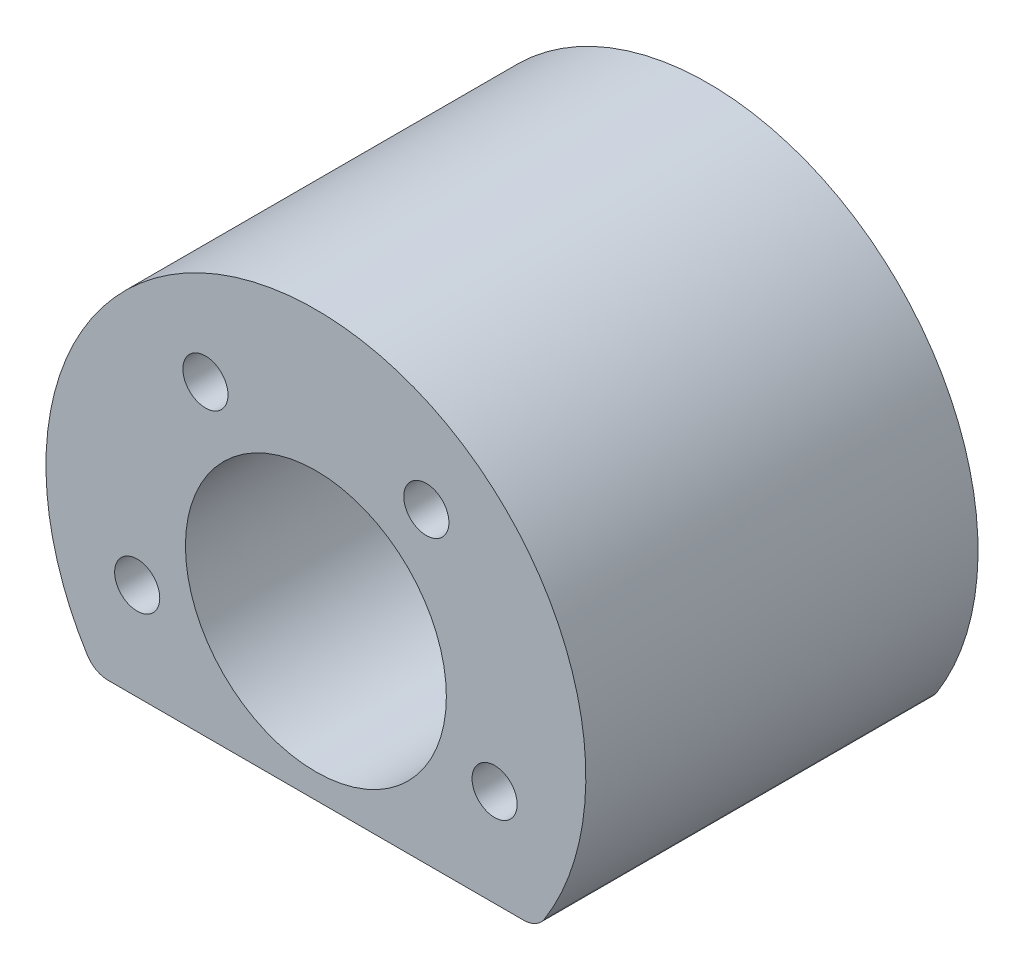
ISO-10303-21;
HEADER;
FILE_DESCRIPTION(('STEP AP214'),'2;1');
FILE_NAME('part.step','',(''),(''),'','','');
FILE_SCHEMA(('AUTOMOTIVE_DESIGN { 1 0 10303 214 1 1 1 1 }'));
ENDSEC;
DATA;
#1=APPLICATION_CONTEXT('core data for automotive mechanical design processes');
#2=APPLICATION_PROTOCOL_DEFINITION('international standard','automotive_design',2000,#1);
#3=PRODUCT_CONTEXT('',#1,'mechanical');
#4=PRODUCT('Part','Part','',(#3));
#5=PRODUCT_RELATED_PRODUCT_CATEGORY('part','',(#4));
#6=PRODUCT_DEFINITION_FORMATION('','',#4);
#7=PRODUCT_DEFINITION_CONTEXT('part definition',#1,'design');
#8=PRODUCT_DEFINITION('design','',#6,#7);
#9=PRODUCT_DEFINITION_SHAPE('','',#8);
#10=(LENGTH_UNIT() NAMED_UNIT(*) SI_UNIT(.MILLI.,.METRE.));
#11=(NAMED_UNIT(*) PLANE_ANGLE_UNIT() SI_UNIT($,.RADIAN.));
#12=(NAMED_UNIT(*) SI_UNIT($,.STERADIAN.) SOLID_ANGLE_UNIT());
#13=UNCERTAINTY_MEASURE_WITH_UNIT(LENGTH_MEASURE(1.E-05),#10,'distance_accuracy_value','');
#14=(GEOMETRIC_REPRESENTATION_CONTEXT(3) GLOBAL_UNCERTAINTY_ASSIGNED_CONTEXT((#13)) GLOBAL_UNIT_ASSIGNED_CONTEXT((#10,
#11,#12)) REPRESENTATION_CONTEXT('',''));
#15=CARTESIAN_POINT('',(0.,0.,0.));
#16=DIRECTION('',(0.,0.,1.));
#17=DIRECTION('',(1.,0.,0.));
#18=AXIS2_PLACEMENT_3D('',#15,#16,#17);
#19=CARTESIAN_POINT('',(0.,-18.9,44.8));
#20=DIRECTION('',(0.,1.,0.));
#21=DIRECTION('',(0.,0.,1.));
#22=AXIS2_PLACEMENT_3D('',#19,#20,#21);
#23=PLANE('',#22);
#24=DIRECTION('',(1.,0.,0.));
#25=VECTOR('',#24,1.);
#26=CARTESIAN_POINT('',(0.,-18.9,44.8));
#27=LINE('',#26,#25);
#28=CARTESIAN_POINT('',(-25.3219272568262,-18.9,44.8));
#29=VERTEX_POINT('',#28);
#30=CARTESIAN_POINT('',(25.3219272568262,-18.9,44.8));
#31=VERTEX_POINT('',#30);
#32=EDGE_CURVE('E95',#29,#31,#27,.T.);
#33=ORIENTED_EDGE('',*,*,#32,.F.);
#34=DIRECTION('',(0.,0.,-1.));
#35=VECTOR('',#34,1.);
#36=CARTESIAN_POINT('',(-25.3219272568262,-18.9,44.8));
#37=LINE('',#36,#35);
#38=CARTESIAN_POINT('',(-25.3219272568262,-18.9,-3.));
#39=VERTEX_POINT('',#38);
#40=EDGE_CURVE('E83',#29,#39,#37,.T.);
#41=ORIENTED_EDGE('',*,*,#40,.T.);
#42=DIRECTION('',(1.,0.,0.));
#43=VECTOR('',#42,1.);
#44=CARTESIAN_POINT('',(0.,-18.9,-3.));
#45=LINE('',#44,#43);
#46=CARTESIAN_POINT('',(25.3219272568262,-18.9,-3.));
#47=VERTEX_POINT('',#46);
#48=EDGE_CURVE('E93',#39,#47,#45,.T.);
#49=ORIENTED_EDGE('',*,*,#48,.T.);
#50=DIRECTION('',(0.,0.,-1.));
#51=VECTOR('',#50,1.);
#52=CARTESIAN_POINT('',(25.3219272568262,-18.9,44.8));
#53=LINE('',#52,#51);
#54=EDGE_CURVE('E96',#47,#31,#53,.F.);
#55=ORIENTED_EDGE('',*,*,#54,.T.);
#56=EDGE_LOOP('',(#33,#41,#49,#55));
#57=FACE_BOUND('',#56,.T.);
#58=ADVANCED_FACE('F37',(#57),#23,.F.);
#59=CARTESIAN_POINT('',(0.,0.,44.8));
#60=DIRECTION('',(0.,0.,-1.));
#61=DIRECTION('',(-1.,0.,0.));
#62=AXIS2_PLACEMENT_3D('',#59,#60,#61);
#63=CYLINDRICAL_SURFACE('',#62,15.9);
#64=CARTESIAN_POINT('',(0.,0.,44.8));
#65=DIRECTION('',(0.,0.,1.));
#66=DIRECTION('',(1.,0.,0.));
#67=AXIS2_PLACEMENT_3D('',#64,#65,#66);
#68=CIRCLE('',#67,15.9);
#69=CARTESIAN_POINT('',(15.9,0.,44.8));
#70=VERTEX_POINT('',#69);
#71=EDGE_CURVE('E112',#70,#70,#68,.T.);
#72=ORIENTED_EDGE('',*,*,#71,.T.);
#73=EDGE_LOOP('',(#72));
#74=FACE_BOUND('',#73,.T.);
#75=CARTESIAN_POINT('',(0.,0.,0.));
#76=DIRECTION('',(0.,0.,1.));
#77=DIRECTION('',(1.,0.,0.));
#78=AXIS2_PLACEMENT_3D('',#75,#76,#77);
#79=CIRCLE('',#78,15.9);
#80=CARTESIAN_POINT('',(15.9,0.,0.));
#81=VERTEX_POINT('',#80);
#82=EDGE_CURVE('E102',#81,#81,#79,.T.);
#83=ORIENTED_EDGE('',*,*,#82,.F.);
#84=EDGE_LOOP('',(#83));
#85=FACE_BOUND('',#84,.T.);
#86=ADVANCED_FACE('F191',(#74,#85),#63,.F.);
#87=CARTESIAN_POINT('',(0.,0.,44.8));
#88=DIRECTION('',(0.,0.,-1.));
#89=DIRECTION('',(-1.,0.,0.));
#90=AXIS2_PLACEMENT_3D('',#87,#88,#89);
#91=CYLINDRICAL_SURFACE('',#90,32.9);
#92=CARTESIAN_POINT('',(0.,0.,-3.));
#93=DIRECTION('',(0.,0.,1.));
#94=DIRECTION('',(1.,0.,0.));
#95=AXIS2_PLACEMENT_3D('',#92,#93,#94);
#96=CIRCLE('',#95,32.9);
#97=CARTESIAN_POINT('',(27.8625888545011,-17.4953177257525,-3.));
#98=VERTEX_POINT('',#97);
#99=CARTESIAN_POINT('',(-27.8625888545011,-17.4953177257525,-3.));
#100=VERTEX_POINT('',#99);
#101=EDGE_CURVE('E99',#98,#100,#96,.T.);
#102=ORIENTED_EDGE('',*,*,#101,.T.);
#103=DIRECTION('',(0.,0.,-1.));
#104=VECTOR('',#103,1.);
#105=CARTESIAN_POINT('',(-27.8625888545011,-17.4953177257525,44.8));
#106=LINE('',#105,#104);
#107=CARTESIAN_POINT('',(-27.8625888545011,-17.4953177257525,44.8));
#108=VERTEX_POINT('',#107);
#109=EDGE_CURVE('E54',#100,#108,#106,.F.);
#110=ORIENTED_EDGE('',*,*,#109,.T.);
#111=CARTESIAN_POINT('',(0.,0.,44.8));
#112=DIRECTION('',(0.,0.,1.));
#113=DIRECTION('',(1.,0.,0.));
#114=AXIS2_PLACEMENT_3D('',#111,#112,#113);
#115=CIRCLE('',#114,32.9);
#116=CARTESIAN_POINT('',(27.8625888545011,-17.4953177257525,44.8));
#117=VERTEX_POINT('',#116);
#118=EDGE_CURVE('E116',#117,#108,#115,.T.);
#119=ORIENTED_EDGE('',*,*,#118,.F.);
#120=DIRECTION('',(0.,0.,-1.));
#121=VECTOR('',#120,1.);
#122=CARTESIAN_POINT('',(27.8625888545011,-17.4953177257525,44.8));
#123=LINE('',#122,#121);
#124=EDGE_CURVE('E87',#117,#98,#123,.T.);
#125=ORIENTED_EDGE('',*,*,#124,.T.);
#126=EDGE_LOOP('',(#102,#110,#119,#125));
#127=FACE_BOUND('',#126,.T.);
#128=ADVANCED_FACE('F174',(#127),#91,.T.);
#129=CARTESIAN_POINT('',(0.,0.,44.8));
#130=DIRECTION('',(0.,0.,1.));
#131=DIRECTION('',(1.,0.,0.));
#132=AXIS2_PLACEMENT_3D('',#129,#130,#131);
#133=PLANE('',#132);
#134=CARTESIAN_POINT('',(-13.4602822774975,18.5264891711864,44.8));
#135=DIRECTION('',(0.,0.,1.));
#136=DIRECTION('',(1.,0.,0.));
#137=AXIS2_PLACEMENT_3D('',#134,#135,#136);
#138=CIRCLE('',#137,2.74999999999999);
#139=CARTESIAN_POINT('',(-10.7102822774975,18.5264891711864,44.8));
#140=VERTEX_POINT('',#139);
#141=EDGE_CURVE('E129',#140,#140,#138,.T.);
#142=ORIENTED_EDGE('',*,*,#141,.F.);
#143=EDGE_LOOP('',(#142));
#144=FACE_BOUND('',#143,.T.);
#145=CARTESIAN_POINT('',(-21.779194223159,-7.07648917118623,44.8));
#146=DIRECTION('',(0.,0.,1.));
#147=DIRECTION('',(1.,0.,0.));
#148=AXIS2_PLACEMENT_3D('',#145,#146,#147);
#149=CIRCLE('',#148,2.74999999999999);
#150=CARTESIAN_POINT('',(-19.029194223159,-7.07648917118623,44.8));
#151=VERTEX_POINT('',#150);
#152=EDGE_CURVE('E160',#151,#151,#149,.T.);
#153=ORIENTED_EDGE('',*,*,#152,.F.);
#154=EDGE_LOOP('',(#153));
#155=FACE_BOUND('',#154,.T.);
#156=CARTESIAN_POINT('',(21.779194223159,-7.07648917118623,44.8));
#157=DIRECTION('',(0.,0.,1.));
#158=DIRECTION('',(1.,0.,0.));
#159=AXIS2_PLACEMENT_3D('',#156,#157,#158);
#160=CIRCLE('',#159,2.74999999999999);
#161=CARTESIAN_POINT('',(24.529194223159,-7.07648917118623,44.8));
#162=VERTEX_POINT('',#161);
#163=EDGE_CURVE('E163',#162,#162,#160,.T.);
#164=ORIENTED_EDGE('',*,*,#163,.F.);
#165=EDGE_LOOP('',(#164));
#166=FACE_BOUND('',#165,.T.);
#167=CARTESIAN_POINT('',(13.4602822774975,18.5264891711864,44.8));
#168=DIRECTION('',(0.,0.,1.));
#169=DIRECTION('',(1.,0.,0.));
#170=AXIS2_PLACEMENT_3D('',#167,#168,#169);
#171=CIRCLE('',#170,2.74999999999999);
#172=CARTESIAN_POINT('',(16.2102822774975,18.5264891711864,44.8));
#173=VERTEX_POINT('',#172);
#174=EDGE_CURVE('E111',#173,#173,#171,.T.);
#175=ORIENTED_EDGE('',*,*,#174,.F.);
#176=EDGE_LOOP('',(#175));
#177=FACE_BOUND('',#176,.T.);
#178=ORIENTED_EDGE('',*,*,#71,.F.);
#179=EDGE_LOOP('',(#178));
#180=FACE_BOUND('',#179,.T.);
#181=ORIENTED_EDGE('',*,*,#118,.T.);
#182=CARTESIAN_POINT('',(-25.3219272568262,-15.9,44.8));
#183=DIRECTION('',(0.,0.,1.));
#184=DIRECTION('',(1.,0.,0.));
#185=AXIS2_PLACEMENT_3D('',#182,#183,#184);
#186=CIRCLE('',#185,3.);
#187=EDGE_CURVE('E11',#108,#29,#186,.T.);
#188=ORIENTED_EDGE('',*,*,#187,.T.);
#189=ORIENTED_EDGE('',*,*,#32,.T.);
#190=CARTESIAN_POINT('',(25.3219272568262,-15.9,44.8));
#191=DIRECTION('',(0.,0.,1.));
#192=DIRECTION('',(1.,0.,0.));
#193=AXIS2_PLACEMENT_3D('',#190,#191,#192);
#194=CIRCLE('',#193,3.);
#195=EDGE_CURVE('E46',#31,#117,#194,.T.);
#196=ORIENTED_EDGE('',*,*,#195,.T.);
#197=EDGE_LOOP('',(#181,#188,#189,#196));
#198=FACE_BOUND('',#197,.T.);
#199=ADVANCED_FACE('F170',(#144,#155,#166,#177,#180,#198),#133,.T.);
#200=CARTESIAN_POINT('',(0.,0.,0.));
#201=DIRECTION('',(0.,0.,1.));
#202=DIRECTION('',(1.,0.,0.));
#203=AXIS2_PLACEMENT_3D('',#200,#201,#202);
#204=PLANE('',#203);
#205=CARTESIAN_POINT('',(0.,0.,0.));
#206=DIRECTION('',(0.,0.,1.));
#207=DIRECTION('',(1.,0.,0.));
#208=AXIS2_PLACEMENT_3D('',#205,#206,#207);
#209=CIRCLE('',#208,11.);
#210=CARTESIAN_POINT('',(11.,0.,0.));
#211=VERTEX_POINT('',#210);
#212=EDGE_CURVE('E105',#211,#211,#209,.T.);
#213=ORIENTED_EDGE('',*,*,#212,.F.);
#214=EDGE_LOOP('',(#213));
#215=FACE_BOUND('',#214,.T.);
#216=ORIENTED_EDGE('',*,*,#82,.T.);
#217=EDGE_LOOP('',(#216));
#218=FACE_BOUND('',#217,.T.);
#219=ADVANCED_FACE('F173',(#215,#218),#204,.T.);
#220=CARTESIAN_POINT('',(0.,0.,-3.));
#221=DIRECTION('',(0.,0.,1.));
#222=DIRECTION('',(1.,0.,0.));
#223=AXIS2_PLACEMENT_3D('',#220,#221,#222);
#224=CYLINDRICAL_SURFACE('',#223,11.);
#225=CARTESIAN_POINT('',(0.,0.,-3.));
#226=DIRECTION('',(0.,0.,1.));
#227=DIRECTION('',(1.,0.,0.));
#228=AXIS2_PLACEMENT_3D('',#225,#226,#227);
#229=CIRCLE('',#228,11.);
#230=CARTESIAN_POINT('',(11.,0.,-3.));
#231=VERTEX_POINT('',#230);
#232=EDGE_CURVE('E100',#231,#231,#229,.T.);
#233=ORIENTED_EDGE('',*,*,#232,.F.);
#234=EDGE_LOOP('',(#233));
#235=FACE_BOUND('',#234,.T.);
#236=ORIENTED_EDGE('',*,*,#212,.T.);
#237=EDGE_LOOP('',(#236));
#238=FACE_BOUND('',#237,.T.);
#239=ADVANCED_FACE('F201',(#235,#238),#224,.F.);
#240=CARTESIAN_POINT('',(0.,0.,-3.));
#241=DIRECTION('',(0.,0.,1.));
#242=DIRECTION('',(1.,0.,0.));
#243=AXIS2_PLACEMENT_3D('',#240,#241,#242);
#244=PLANE('',#243);
#245=CARTESIAN_POINT('',(13.4602822774975,18.5264891711864,-3.));
#246=DIRECTION('',(0.,0.,-1.));
#247=DIRECTION('',(-1.,0.,0.));
#248=AXIS2_PLACEMENT_3D('',#245,#246,#247);
#249=CIRCLE('',#248,3.2);
#250=CARTESIAN_POINT('',(10.2602822774975,18.5264891711864,-3.));
#251=VERTEX_POINT('',#250);
#252=EDGE_CURVE('E257',#251,#251,#249,.T.);
#253=ORIENTED_EDGE('',*,*,#252,.F.);
#254=EDGE_LOOP('',(#253));
#255=FACE_BOUND('',#254,.T.);
#256=CARTESIAN_POINT('',(21.779194223159,-7.07648917118623,-3.));
#257=DIRECTION('',(0.,0.,-1.));
#258=DIRECTION('',(-1.,0.,0.));
#259=AXIS2_PLACEMENT_3D('',#256,#257,#258);
#260=CIRCLE('',#259,3.2);
#261=CARTESIAN_POINT('',(18.579194223159,-7.07648917118623,-3.));
#262=VERTEX_POINT('',#261);
#263=EDGE_CURVE('E144',#262,#262,#260,.T.);
#264=ORIENTED_EDGE('',*,*,#263,.F.);
#265=EDGE_LOOP('',(#264));
#266=FACE_BOUND('',#265,.T.);
#267=CARTESIAN_POINT('',(-21.779194223159,-7.07648917118623,-3.));
#268=DIRECTION('',(0.,0.,-1.));
#269=DIRECTION('',(-1.,0.,0.));
#270=AXIS2_PLACEMENT_3D('',#267,#268,#269);
#271=CIRCLE('',#270,3.2);
#272=CARTESIAN_POINT('',(-24.979194223159,-7.07648917118623,-3.));
#273=VERTEX_POINT('',#272);
#274=EDGE_CURVE('E137',#273,#273,#271,.T.);
#275=ORIENTED_EDGE('',*,*,#274,.F.);
#276=EDGE_LOOP('',(#275));
#277=FACE_BOUND('',#276,.T.);
#278=CARTESIAN_POINT('',(-13.4602822774975,18.5264891711864,-3.));
#279=DIRECTION('',(0.,0.,-1.));
#280=DIRECTION('',(-1.,0.,0.));
#281=AXIS2_PLACEMENT_3D('',#278,#279,#280);
#282=CIRCLE('',#281,3.2);
#283=CARTESIAN_POINT('',(-16.6602822774975,18.5264891711864,-3.));
#284=VERTEX_POINT('',#283);
#285=EDGE_CURVE('E133',#284,#284,#282,.T.);
#286=ORIENTED_EDGE('',*,*,#285,.F.);
#287=EDGE_LOOP('',(#286));
#288=FACE_BOUND('',#287,.T.);
#289=ORIENTED_EDGE('',*,*,#232,.T.);
#290=EDGE_LOOP('',(#289));
#291=FACE_BOUND('',#290,.T.);
#292=ORIENTED_EDGE('',*,*,#48,.F.);
#293=CARTESIAN_POINT('',(-25.3219272568262,-15.9,-3.));
#294=DIRECTION('',(0.,0.,1.));
#295=DIRECTION('',(1.,0.,0.));
#296=AXIS2_PLACEMENT_3D('',#293,#294,#295);
#297=CIRCLE('',#296,3.);
#298=EDGE_CURVE('E79',#39,#100,#297,.F.);
#299=ORIENTED_EDGE('',*,*,#298,.T.);
#300=ORIENTED_EDGE('',*,*,#101,.F.);
#301=CARTESIAN_POINT('',(25.3219272568262,-15.9,-3.));
#302=DIRECTION('',(0.,0.,1.));
#303=DIRECTION('',(1.,0.,0.));
#304=AXIS2_PLACEMENT_3D('',#301,#302,#303);
#305=CIRCLE('',#304,3.);
#306=EDGE_CURVE('E88',#98,#47,#305,.F.);
#307=ORIENTED_EDGE('',*,*,#306,.T.);
#308=EDGE_LOOP('',(#292,#299,#300,#307));
#309=FACE_BOUND('',#308,.T.);
#310=ADVANCED_FACE('F98',(#255,#266,#277,#288,#291,#309),#244,.F.);
#311=CARTESIAN_POINT('',(13.4602822774975,18.5264891711864,44.8));
#312=DIRECTION('',(0.,0.,1.));
#313=DIRECTION('',(1.,0.,0.));
#314=AXIS2_PLACEMENT_3D('',#311,#312,#313);
#315=CYLINDRICAL_SURFACE('',#314,2.74999999999999);
#316=CARTESIAN_POINT('',(13.4602822774975,18.5264891711864,7.27038727856241));
#317=DIRECTION('',(0.,0.,-1.));
#318=DIRECTION('',(-1.,0.,0.));
#319=AXIS2_PLACEMENT_3D('',#316,#317,#318);
#320=CIRCLE('',#319,2.74999999999999);
#321=CARTESIAN_POINT('',(10.7102822774975,18.5264891711864,7.27038727856241));
#322=VERTEX_POINT('',#321);
#323=EDGE_CURVE('E41',#322,#322,#320,.T.);
#324=ORIENTED_EDGE('',*,*,#323,.T.);
#325=EDGE_LOOP('',(#324));
#326=FACE_BOUND('',#325,.T.);
#327=ORIENTED_EDGE('',*,*,#174,.T.);
#328=EDGE_LOOP('',(#327));
#329=FACE_BOUND('',#328,.T.);
#330=ADVANCED_FACE('F168',(#326,#329),#315,.F.);
#331=CARTESIAN_POINT('',(21.779194223159,-7.07648917118623,44.8));
#332=DIRECTION('',(0.,0.,1.));
#333=DIRECTION('',(1.,0.,0.));
#334=AXIS2_PLACEMENT_3D('',#331,#332,#333);
#335=CYLINDRICAL_SURFACE('',#334,2.74999999999999);
#336=CARTESIAN_POINT('',(21.779194223159,-7.07648917118623,7.27038727856241));
#337=DIRECTION('',(0.,0.,-1.));
#338=DIRECTION('',(-1.,0.,0.));
#339=AXIS2_PLACEMENT_3D('',#336,#337,#338);
#340=CIRCLE('',#339,2.74999999999999);
#341=CARTESIAN_POINT('',(19.0291942231591,-7.07648917118623,7.27038727856241));
#342=VERTEX_POINT('',#341);
#343=EDGE_CURVE('E135',#342,#342,#340,.T.);
#344=ORIENTED_EDGE('',*,*,#343,.T.);
#345=EDGE_LOOP('',(#344));
#346=FACE_BOUND('',#345,.T.);
#347=ORIENTED_EDGE('',*,*,#163,.T.);
#348=EDGE_LOOP('',(#347));
#349=FACE_BOUND('',#348,.T.);
#350=ADVANCED_FACE('F213',(#346,#349),#335,.F.);
#351=CARTESIAN_POINT('',(-21.779194223159,-7.07648917118623,44.8));
#352=DIRECTION('',(0.,0.,1.));
#353=DIRECTION('',(1.,0.,0.));
#354=AXIS2_PLACEMENT_3D('',#351,#352,#353);
#355=CYLINDRICAL_SURFACE('',#354,2.74999999999999);
#356=CARTESIAN_POINT('',(-21.779194223159,-7.07648917118623,7.27038727856241));
#357=DIRECTION('',(0.,0.,-1.));
#358=DIRECTION('',(-1.,0.,0.));
#359=AXIS2_PLACEMENT_3D('',#356,#357,#358);
#360=CIRCLE('',#359,2.74999999999999);
#361=CARTESIAN_POINT('',(-24.529194223159,-7.07648917118623,7.27038727856241));
#362=VERTEX_POINT('',#361);
#363=EDGE_CURVE('E131',#362,#362,#360,.T.);
#364=ORIENTED_EDGE('',*,*,#363,.T.);
#365=EDGE_LOOP('',(#364));
#366=FACE_BOUND('',#365,.T.);
#367=ORIENTED_EDGE('',*,*,#152,.T.);
#368=EDGE_LOOP('',(#367));
#369=FACE_BOUND('',#368,.T.);
#370=ADVANCED_FACE('F217',(#366,#369),#355,.F.);
#371=CARTESIAN_POINT('',(-13.4602822774975,18.5264891711864,44.8));
#372=DIRECTION('',(0.,0.,1.));
#373=DIRECTION('',(1.,0.,0.));
#374=AXIS2_PLACEMENT_3D('',#371,#372,#373);
#375=CYLINDRICAL_SURFACE('',#374,2.74999999999999);
#376=CARTESIAN_POINT('',(-13.4602822774975,18.5264891711864,7.27038727856241));
#377=DIRECTION('',(0.,0.,-1.));
#378=DIRECTION('',(-1.,0.,0.));
#379=AXIS2_PLACEMENT_3D('',#376,#377,#378);
#380=CIRCLE('',#379,2.74999999999999);
#381=CARTESIAN_POINT('',(-16.2102822774975,18.5264891711864,7.27038727856241));
#382=VERTEX_POINT('',#381);
#383=EDGE_CURVE('E126',#382,#382,#380,.T.);
#384=ORIENTED_EDGE('',*,*,#383,.T.);
#385=EDGE_LOOP('',(#384));
#386=FACE_BOUND('',#385,.T.);
#387=ORIENTED_EDGE('',*,*,#141,.T.);
#388=EDGE_LOOP('',(#387));
#389=FACE_BOUND('',#388,.T.);
#390=ADVANCED_FACE('F189',(#386,#389),#375,.F.);
#391=CARTESIAN_POINT('',(-25.3219272568262,-15.9,44.8));
#392=DIRECTION('',(0.,0.,-1.));
#393=DIRECTION('',(-1.,0.,0.));
#394=AXIS2_PLACEMENT_3D('',#391,#392,#393);
#395=CYLINDRICAL_SURFACE('',#394,3.);
#396=ORIENTED_EDGE('',*,*,#187,.F.);
#397=ORIENTED_EDGE('',*,*,#109,.F.);
#398=ORIENTED_EDGE('',*,*,#298,.F.);
#399=ORIENTED_EDGE('',*,*,#40,.F.);
#400=EDGE_LOOP('',(#396,#397,#398,#399));
#401=FACE_BOUND('',#400,.T.);
#402=ADVANCED_FACE('F82',(#401),#395,.T.);
#403=CARTESIAN_POINT('',(25.3219272568262,-15.9,44.8));
#404=DIRECTION('',(0.,0.,-1.));
#405=DIRECTION('',(-1.,0.,0.));
#406=AXIS2_PLACEMENT_3D('',#403,#404,#405);
#407=CYLINDRICAL_SURFACE('',#406,3.);
#408=ORIENTED_EDGE('',*,*,#195,.F.);
#409=ORIENTED_EDGE('',*,*,#54,.F.);
#410=ORIENTED_EDGE('',*,*,#306,.F.);
#411=ORIENTED_EDGE('',*,*,#124,.F.);
#412=EDGE_LOOP('',(#408,#409,#410,#411));
#413=FACE_BOUND('',#412,.T.);
#414=ADVANCED_FACE('F39',(#413),#407,.T.);
#415=CARTESIAN_POINT('',(-13.4602822774975,18.5264891711864,7.));
#416=DIRECTION('',(0.,0.,-1.));
#417=DIRECTION('',(-1.,0.,0.));
#418=AXIS2_PLACEMENT_3D('',#415,#416,#417);
#419=CONICAL_SURFACE('',#418,3.2,1.02974425867665);
#420=CARTESIAN_POINT('',(-13.4602822774975,18.5264891711864,7.));
#421=DIRECTION('',(0.,0.,-1.));
#422=DIRECTION('',(-1.,0.,0.));
#423=AXIS2_PLACEMENT_3D('',#420,#421,#422);
#424=CIRCLE('',#423,3.2);
#425=CARTESIAN_POINT('',(-16.6602822774975,18.5264891711864,7.));
#426=VERTEX_POINT('',#425);
#427=EDGE_CURVE('E130',#426,#426,#424,.T.);
#428=ORIENTED_EDGE('',*,*,#427,.T.);
#429=EDGE_LOOP('',(#428));
#430=FACE_BOUND('',#429,.T.);
#431=ORIENTED_EDGE('',*,*,#383,.F.);
#432=EDGE_LOOP('',(#431));
#433=FACE_BOUND('',#432,.T.);
#434=ADVANCED_FACE('F181',(#430,#433),#419,.F.);
#435=CARTESIAN_POINT('',(-13.4602822774975,18.5264891711864,-3.));
#436=DIRECTION('',(0.,0.,-1.));
#437=DIRECTION('',(-1.,0.,0.));
#438=AXIS2_PLACEMENT_3D('',#435,#436,#437);
#439=CYLINDRICAL_SURFACE('',#438,3.2);
#440=ORIENTED_EDGE('',*,*,#427,.F.);
#441=EDGE_LOOP('',(#440));
#442=FACE_BOUND('',#441,.T.);
#443=ORIENTED_EDGE('',*,*,#285,.T.);
#444=EDGE_LOOP('',(#443));
#445=FACE_BOUND('',#444,.T.);
#446=ADVANCED_FACE('F186',(#442,#445),#439,.F.);
#447=CARTESIAN_POINT('',(-21.779194223159,-7.07648917118623,7.));
#448=DIRECTION('',(0.,0.,-1.));
#449=DIRECTION('',(-1.,0.,0.));
#450=AXIS2_PLACEMENT_3D('',#447,#448,#449);
#451=CONICAL_SURFACE('',#450,3.2,1.02974425867665);
#452=CARTESIAN_POINT('',(-21.779194223159,-7.07648917118623,7.));
#453=DIRECTION('',(0.,0.,-1.));
#454=DIRECTION('',(-1.,0.,0.));
#455=AXIS2_PLACEMENT_3D('',#452,#453,#454);
#456=CIRCLE('',#455,3.2);
#457=CARTESIAN_POINT('',(-24.979194223159,-7.07648917118623,7.));
#458=VERTEX_POINT('',#457);
#459=EDGE_CURVE('E134',#458,#458,#456,.T.);
#460=ORIENTED_EDGE('',*,*,#459,.T.);
#461=EDGE_LOOP('',(#460));
#462=FACE_BOUND('',#461,.T.);
#463=ORIENTED_EDGE('',*,*,#363,.F.);
#464=EDGE_LOOP('',(#463));
#465=FACE_BOUND('',#464,.T.);
#466=ADVANCED_FACE('F226',(#462,#465),#451,.F.);
#467=CARTESIAN_POINT('',(-21.779194223159,-7.07648917118623,-3.));
#468=DIRECTION('',(0.,0.,-1.));
#469=DIRECTION('',(-1.,0.,0.));
#470=AXIS2_PLACEMENT_3D('',#467,#468,#469);
#471=CYLINDRICAL_SURFACE('',#470,3.2);
#472=ORIENTED_EDGE('',*,*,#459,.F.);
#473=EDGE_LOOP('',(#472));
#474=FACE_BOUND('',#473,.T.);
#475=ORIENTED_EDGE('',*,*,#274,.T.);
#476=EDGE_LOOP('',(#475));
#477=FACE_BOUND('',#476,.T.);
#478=ADVANCED_FACE('F230',(#474,#477),#471,.F.);
#479=CARTESIAN_POINT('',(21.779194223159,-7.07648917118623,7.));
#480=DIRECTION('',(0.,0.,-1.));
#481=DIRECTION('',(-1.,0.,0.));
#482=AXIS2_PLACEMENT_3D('',#479,#480,#481);
#483=CONICAL_SURFACE('',#482,3.2,1.02974425867665);
#484=CARTESIAN_POINT('',(21.779194223159,-7.07648917118623,7.));
#485=DIRECTION('',(0.,0.,-1.));
#486=DIRECTION('',(-1.,0.,0.));
#487=AXIS2_PLACEMENT_3D('',#484,#485,#486);
#488=CIRCLE('',#487,3.2);
#489=CARTESIAN_POINT('',(18.579194223159,-7.07648917118623,7.));
#490=VERTEX_POINT('',#489);
#491=EDGE_CURVE('E138',#490,#490,#488,.T.);
#492=ORIENTED_EDGE('',*,*,#491,.T.);
#493=EDGE_LOOP('',(#492));
#494=FACE_BOUND('',#493,.T.);
#495=ORIENTED_EDGE('',*,*,#343,.F.);
#496=EDGE_LOOP('',(#495));
#497=FACE_BOUND('',#496,.T.);
#498=ADVANCED_FACE('F234',(#494,#497),#483,.F.);
#499=CARTESIAN_POINT('',(21.779194223159,-7.07648917118623,-3.));
#500=DIRECTION('',(0.,0.,-1.));
#501=DIRECTION('',(-1.,0.,0.));
#502=AXIS2_PLACEMENT_3D('',#499,#500,#501);
#503=CYLINDRICAL_SURFACE('',#502,3.2);
#504=ORIENTED_EDGE('',*,*,#491,.F.);
#505=EDGE_LOOP('',(#504));
#506=FACE_BOUND('',#505,.T.);
#507=ORIENTED_EDGE('',*,*,#263,.T.);
#508=EDGE_LOOP('',(#507));
#509=FACE_BOUND('',#508,.T.);
#510=ADVANCED_FACE('F238',(#506,#509),#503,.F.);
#511=CARTESIAN_POINT('',(13.4602822774975,18.5264891711864,7.));
#512=DIRECTION('',(0.,0.,-1.));
#513=DIRECTION('',(-1.,0.,0.));
#514=AXIS2_PLACEMENT_3D('',#511,#512,#513);
#515=CONICAL_SURFACE('',#514,3.2,1.02974425867665);
#516=CARTESIAN_POINT('',(13.4602822774975,18.5264891711864,7.));
#517=DIRECTION('',(0.,0.,-1.));
#518=DIRECTION('',(-1.,0.,0.));
#519=AXIS2_PLACEMENT_3D('',#516,#517,#518);
#520=CIRCLE('',#519,3.2);
#521=CARTESIAN_POINT('',(10.2602822774975,18.5264891711864,7.));
#522=VERTEX_POINT('',#521);
#523=EDGE_CURVE('E254',#522,#522,#520,.T.);
#524=ORIENTED_EDGE('',*,*,#523,.T.);
#525=EDGE_LOOP('',(#524));
#526=FACE_BOUND('',#525,.T.);
#527=ORIENTED_EDGE('',*,*,#323,.F.);
#528=EDGE_LOOP('',(#527));
#529=FACE_BOUND('',#528,.T.);
#530=ADVANCED_FACE('F241',(#526,#529),#515,.F.);
#531=CARTESIAN_POINT('',(13.4602822774975,18.5264891711864,-3.));
#532=DIRECTION('',(0.,0.,-1.));
#533=DIRECTION('',(-1.,0.,0.));
#534=AXIS2_PLACEMENT_3D('',#531,#532,#533);
#535=CYLINDRICAL_SURFACE('',#534,3.2);
#536=ORIENTED_EDGE('',*,*,#523,.F.);
#537=EDGE_LOOP('',(#536));
#538=FACE_BOUND('',#537,.T.);
#539=ORIENTED_EDGE('',*,*,#252,.T.);
#540=EDGE_LOOP('',(#539));
#541=FACE_BOUND('',#540,.T.);
#542=ADVANCED_FACE('F245',(#538,#541),#535,.F.);
#543=CLOSED_SHELL('',(#58,#86,#128,#199,#219,#239,#310,#330,#350,#370,#390,#402,#414,#434,#446,
#466,#478,#498,#510,#530,#542));
#544=MANIFOLD_SOLID_BREP('B2',#543);
#545=ADVANCED_BREP_SHAPE_REPRESENTATION('',(#18,#544),#14);
#546=SHAPE_DEFINITION_REPRESENTATION(#9,#545);
ENDSEC;
END-ISO-10303-21;
